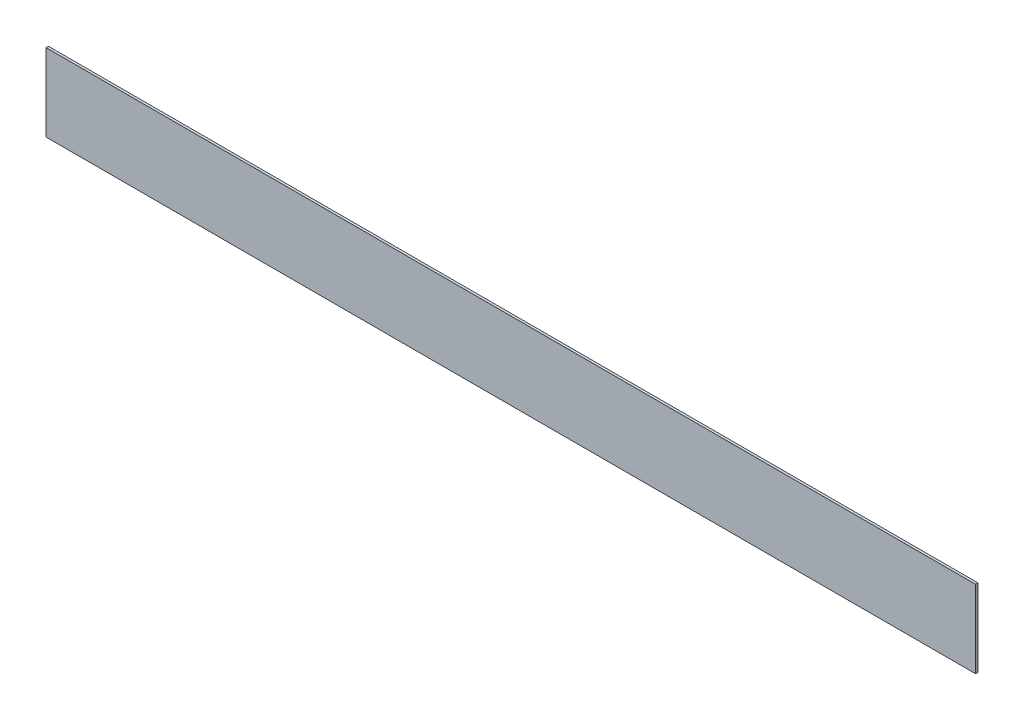
ISO-10303-21;
HEADER;
FILE_DESCRIPTION(('STEP AP214'),'2;1');
FILE_NAME('part.step','',(''),(''),'','','');
FILE_SCHEMA(('AUTOMOTIVE_DESIGN { 1 0 10303 214 1 1 1 1 }'));
ENDSEC;
DATA;
#1=APPLICATION_CONTEXT('core data for automotive mechanical design processes');
#2=APPLICATION_PROTOCOL_DEFINITION('international standard','automotive_design',2000,#1);
#3=PRODUCT_CONTEXT('',#1,'mechanical');
#4=PRODUCT('Part','Part','',(#3));
#5=PRODUCT_RELATED_PRODUCT_CATEGORY('part','',(#4));
#6=PRODUCT_DEFINITION_FORMATION('','',#4);
#7=PRODUCT_DEFINITION_CONTEXT('part definition',#1,'design');
#8=PRODUCT_DEFINITION('design','',#6,#7);
#9=PRODUCT_DEFINITION_SHAPE('','',#8);
#10=(LENGTH_UNIT() NAMED_UNIT(*) SI_UNIT(.MILLI.,.METRE.));
#11=(NAMED_UNIT(*) PLANE_ANGLE_UNIT() SI_UNIT($,.RADIAN.));
#12=(NAMED_UNIT(*) SI_UNIT($,.STERADIAN.) SOLID_ANGLE_UNIT());
#13=UNCERTAINTY_MEASURE_WITH_UNIT(LENGTH_MEASURE(1.E-05),#10,'distance_accuracy_value','');
#14=(GEOMETRIC_REPRESENTATION_CONTEXT(3) GLOBAL_UNCERTAINTY_ASSIGNED_CONTEXT((#13)) GLOBAL_UNIT_ASSIGNED_CONTEXT((#10,
#11,#12)) REPRESENTATION_CONTEXT('',''));
#15=CARTESIAN_POINT('',(0.,0.,0.));
#16=DIRECTION('',(0.,0.,1.));
#17=DIRECTION('',(1.,0.,0.));
#18=AXIS2_PLACEMENT_3D('',#15,#16,#17);
#19=CARTESIAN_POINT('',(0.,0.,1.5875));
#20=DIRECTION('',(1.,0.,0.));
#21=DIRECTION('',(0.,0.,-1.));
#22=AXIS2_PLACEMENT_3D('',#19,#20,#21);
#23=PLANE('',#22);
#24=DIRECTION('',(0.,-1.,0.));
#25=VECTOR('',#24,1.);
#26=CARTESIAN_POINT('',(0.,0.,0.));
#27=LINE('',#26,#25);
#28=CARTESIAN_POINT('',(0.,50.8,0.));
#29=VERTEX_POINT('',#28);
#30=CARTESIAN_POINT('',(0.,0.,0.));
#31=VERTEX_POINT('',#30);
#32=EDGE_CURVE('E96',#29,#31,#27,.T.);
#33=ORIENTED_EDGE('',*,*,#32,.T.);
#34=DIRECTION('',(0.,0.,-1.));
#35=VECTOR('',#34,1.);
#36=CARTESIAN_POINT('',(0.,0.,1.5875));
#37=LINE('',#36,#35);
#38=CARTESIAN_POINT('',(0.,0.,1.5875));
#39=VERTEX_POINT('',#38);
#40=EDGE_CURVE('E11',#39,#31,#37,.T.);
#41=ORIENTED_EDGE('',*,*,#40,.F.);
#42=DIRECTION('',(0.,-1.,0.));
#43=VECTOR('',#42,1.);
#44=CARTESIAN_POINT('',(0.,0.,1.5875));
#45=LINE('',#44,#43);
#46=CARTESIAN_POINT('',(0.,50.8,1.5875));
#47=VERTEX_POINT('',#46);
#48=EDGE_CURVE('E84',#47,#39,#45,.T.);
#49=ORIENTED_EDGE('',*,*,#48,.F.);
#50=DIRECTION('',(0.,0.,-1.));
#51=VECTOR('',#50,1.);
#52=CARTESIAN_POINT('',(0.,50.8,1.5875));
#53=LINE('',#52,#51);
#54=EDGE_CURVE('E92',#47,#29,#53,.T.);
#55=ORIENTED_EDGE('',*,*,#54,.T.);
#56=EDGE_LOOP('',(#33,#41,#49,#55));
#57=FACE_BOUND('',#56,.T.);
#58=ADVANCED_FACE('F33',(#57),#23,.F.);
#59=CARTESIAN_POINT('',(0.,0.,1.5875));
#60=DIRECTION('',(0.,1.,0.));
#61=DIRECTION('',(0.,0.,1.));
#62=AXIS2_PLACEMENT_3D('',#59,#60,#61);
#63=PLANE('',#62);
#64=DIRECTION('',(1.,0.,0.));
#65=VECTOR('',#64,1.);
#66=CARTESIAN_POINT('',(0.,0.,0.));
#67=LINE('',#66,#65);
#68=CARTESIAN_POINT('',(609.6,0.,0.));
#69=VERTEX_POINT('',#68);
#70=EDGE_CURVE('E88',#31,#69,#67,.T.);
#71=ORIENTED_EDGE('',*,*,#70,.T.);
#72=DIRECTION('',(0.,0.,-1.));
#73=VECTOR('',#72,1.);
#74=CARTESIAN_POINT('',(609.6,0.,1.5875));
#75=LINE('',#74,#73);
#76=CARTESIAN_POINT('',(609.6,0.,1.5875));
#77=VERTEX_POINT('',#76);
#78=EDGE_CURVE('E41',#77,#69,#75,.T.);
#79=ORIENTED_EDGE('',*,*,#78,.F.);
#80=DIRECTION('',(1.,0.,0.));
#81=VECTOR('',#80,1.);
#82=CARTESIAN_POINT('',(0.,0.,1.5875));
#83=LINE('',#82,#81);
#84=EDGE_CURVE('E79',#39,#77,#83,.T.);
#85=ORIENTED_EDGE('',*,*,#84,.F.);
#86=ORIENTED_EDGE('',*,*,#40,.T.);
#87=EDGE_LOOP('',(#71,#79,#85,#86));
#88=FACE_BOUND('',#87,.T.);
#89=ADVANCED_FACE('F87',(#88),#63,.F.);
#90=CARTESIAN_POINT('',(609.6,0.,1.5875));
#91=DIRECTION('',(-1.,0.,0.));
#92=DIRECTION('',(0.,0.,1.));
#93=AXIS2_PLACEMENT_3D('',#90,#91,#92);
#94=PLANE('',#93);
#95=DIRECTION('',(0.,1.,0.));
#96=VECTOR('',#95,1.);
#97=CARTESIAN_POINT('',(609.6,0.,0.));
#98=LINE('',#97,#96);
#99=CARTESIAN_POINT('',(609.6,50.8,0.));
#100=VERTEX_POINT('',#99);
#101=EDGE_CURVE('E66',#69,#100,#98,.T.);
#102=ORIENTED_EDGE('',*,*,#101,.T.);
#103=DIRECTION('',(0.,0.,-1.));
#104=VECTOR('',#103,1.);
#105=CARTESIAN_POINT('',(609.6,50.8,1.5875));
#106=LINE('',#105,#104);
#107=CARTESIAN_POINT('',(609.6,50.8,1.5875));
#108=VERTEX_POINT('',#107);
#109=EDGE_CURVE('E89',#108,#100,#106,.T.);
#110=ORIENTED_EDGE('',*,*,#109,.F.);
#111=DIRECTION('',(0.,1.,0.));
#112=VECTOR('',#111,1.);
#113=CARTESIAN_POINT('',(609.6,0.,1.5875));
#114=LINE('',#113,#112);
#115=EDGE_CURVE('E82',#77,#108,#114,.T.);
#116=ORIENTED_EDGE('',*,*,#115,.F.);
#117=ORIENTED_EDGE('',*,*,#78,.T.);
#118=EDGE_LOOP('',(#102,#110,#116,#117));
#119=FACE_BOUND('',#118,.T.);
#120=ADVANCED_FACE('F90',(#119),#94,.F.);
#121=CARTESIAN_POINT('',(0.,50.8,1.5875));
#122=DIRECTION('',(0.,-1.,0.));
#123=DIRECTION('',(0.,0.,-1.));
#124=AXIS2_PLACEMENT_3D('',#121,#122,#123);
#125=PLANE('',#124);
#126=DIRECTION('',(-1.,0.,0.));
#127=VECTOR('',#126,1.);
#128=CARTESIAN_POINT('',(0.,50.8,0.));
#129=LINE('',#128,#127);
#130=EDGE_CURVE('E72',#100,#29,#129,.T.);
#131=ORIENTED_EDGE('',*,*,#130,.T.);
#132=ORIENTED_EDGE('',*,*,#54,.F.);
#133=DIRECTION('',(-1.,0.,0.));
#134=VECTOR('',#133,1.);
#135=CARTESIAN_POINT('',(0.,50.8,1.5875));
#136=LINE('',#135,#134);
#137=EDGE_CURVE('E49',#108,#47,#136,.T.);
#138=ORIENTED_EDGE('',*,*,#137,.F.);
#139=ORIENTED_EDGE('',*,*,#109,.T.);
#140=EDGE_LOOP('',(#131,#132,#138,#139));
#141=FACE_BOUND('',#140,.T.);
#142=ADVANCED_FACE('F103',(#141),#125,.F.);
#143=CARTESIAN_POINT('',(0.,0.,1.5875));
#144=DIRECTION('',(0.,0.,-1.));
#145=DIRECTION('',(-1.,0.,0.));
#146=AXIS2_PLACEMENT_3D('',#143,#144,#145);
#147=PLANE('',#146);
#148=ORIENTED_EDGE('',*,*,#48,.T.);
#149=ORIENTED_EDGE('',*,*,#84,.T.);
#150=ORIENTED_EDGE('',*,*,#115,.T.);
#151=ORIENTED_EDGE('',*,*,#137,.T.);
#152=EDGE_LOOP('',(#148,#149,#150,#151));
#153=FACE_BOUND('',#152,.T.);
#154=ADVANCED_FACE('F80',(#153),#147,.F.);
#155=CARTESIAN_POINT('',(0.,0.,0.));
#156=DIRECTION('',(0.,0.,-1.));
#157=DIRECTION('',(-1.,0.,0.));
#158=AXIS2_PLACEMENT_3D('',#155,#156,#157);
#159=PLANE('',#158);
#160=ORIENTED_EDGE('',*,*,#32,.F.);
#161=ORIENTED_EDGE('',*,*,#130,.F.);
#162=ORIENTED_EDGE('',*,*,#101,.F.);
#163=ORIENTED_EDGE('',*,*,#70,.F.);
#164=EDGE_LOOP('',(#160,#161,#162,#163));
#165=FACE_BOUND('',#164,.T.);
#166=ADVANCED_FACE('F106',(#165),#159,.T.);
#167=CLOSED_SHELL('',(#58,#89,#120,#142,#154,#166));
#168=MANIFOLD_SOLID_BREP('B2',#167);
#169=ADVANCED_BREP_SHAPE_REPRESENTATION('',(#18,#168),#14);
#170=SHAPE_DEFINITION_REPRESENTATION(#9,#169);
ENDSEC;
END-ISO-10303-21;
